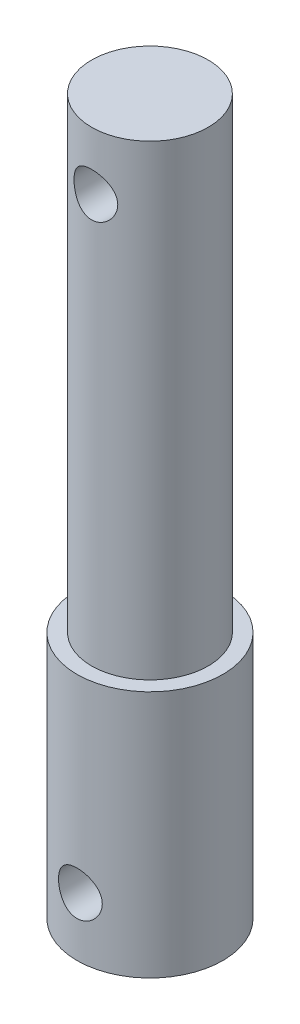
ISO-10303-21;
HEADER;
FILE_DESCRIPTION(('STEP AP214'),'2;1');
FILE_NAME('part.step','',(''),(''),'','','');
FILE_SCHEMA(('AUTOMOTIVE_DESIGN { 1 0 10303 214 1 1 1 1 }'));
ENDSEC;
DATA;
#1=APPLICATION_CONTEXT('core data for automotive mechanical design processes');
#2=APPLICATION_PROTOCOL_DEFINITION('international standard','automotive_design',2000,#1);
#3=PRODUCT_CONTEXT('',#1,'mechanical');
#4=PRODUCT('Part','Part','',(#3));
#5=PRODUCT_RELATED_PRODUCT_CATEGORY('part','',(#4));
#6=PRODUCT_DEFINITION_FORMATION('','',#4);
#7=PRODUCT_DEFINITION_CONTEXT('part definition',#1,'design');
#8=PRODUCT_DEFINITION('design','',#6,#7);
#9=PRODUCT_DEFINITION_SHAPE('','',#8);
#10=(LENGTH_UNIT() NAMED_UNIT(*) SI_UNIT(.MILLI.,.METRE.));
#11=(NAMED_UNIT(*) PLANE_ANGLE_UNIT() SI_UNIT($,.RADIAN.));
#12=(NAMED_UNIT(*) SI_UNIT($,.STERADIAN.) SOLID_ANGLE_UNIT());
#13=UNCERTAINTY_MEASURE_WITH_UNIT(LENGTH_MEASURE(1.E-05),#10,'distance_accuracy_value','');
#14=(GEOMETRIC_REPRESENTATION_CONTEXT(3) GLOBAL_UNCERTAINTY_ASSIGNED_CONTEXT((#13)) GLOBAL_UNIT_ASSIGNED_CONTEXT((#10,
#11,#12)) REPRESENTATION_CONTEXT('',''));
#15=CARTESIAN_POINT('',(0.,0.,0.));
#16=DIRECTION('',(0.,0.,1.));
#17=DIRECTION('',(1.,0.,0.));
#18=AXIS2_PLACEMENT_3D('',#15,#16,#17);
#19=CARTESIAN_POINT('',(0.,17.,0.));
#20=DIRECTION('',(0.,-1.,0.));
#21=DIRECTION('',(0.,0.,-1.));
#22=AXIS2_PLACEMENT_3D('',#19,#20,#21);
#23=CYLINDRICAL_SURFACE('',#22,5.);
#24=CARTESIAN_POINT('',(0.,5.5,-5.));
#25=CARTESIAN_POINT('',(-0.0822886127532999,5.49999900251511,-4.9999992925055));
#26=CARTESIAN_POINT('',(-0.164587318351529,5.49320613637603,-4.99794915693954));
#27=CARTESIAN_POINT('',(-0.326788125304881,5.4662786457779,-4.98997105593691));
#28=CARTESIAN_POINT('',(-0.40668950441142,5.44614004197666,-4.98404193389692));
#29=CARTESIAN_POINT('',(-0.561732707754526,5.39325398308974,-4.96895552501836));
#30=CARTESIAN_POINT('',(-0.636881364395373,5.36052513038106,-4.95980300250425));
#31=CARTESIAN_POINT('',(-0.780624181053131,5.28346390694416,-4.93922109237645));
#32=CARTESIAN_POINT('',(-0.849217467469669,5.23912999260458,-4.92779140192067));
#33=CARTESIAN_POINT('',(-0.979871797183745,5.13877599252733,-4.90350737192774));
#34=CARTESIAN_POINT('',(-1.04171807124434,5.08248337411409,-4.89062383657036));
#35=CARTESIAN_POINT('',(-1.15524920923324,4.96039077008982,-4.86505834210442));
#36=CARTESIAN_POINT('',(-1.20693236327441,4.89458918787504,-4.85237641724501));
#37=CARTESIAN_POINT('',(-1.29980037723708,4.75352924696239,-4.82834113993772));
#38=CARTESIAN_POINT('',(-1.34072309022213,4.67809153900926,-4.81702406663875));
#39=CARTESIAN_POINT('',(-1.4092139477476,4.52101074576971,-4.79743620394031));
#40=CARTESIAN_POINT('',(-1.43678529919973,4.43936915607202,-4.78916468313311));
#41=CARTESIAN_POINT('',(-1.47701633682652,4.27460973386954,-4.77690870838434));
#42=CARTESIAN_POINT('',(-1.49007196234677,4.19159725613606,-4.77281069324533));
#43=CARTESIAN_POINT('',(-1.50213730614672,4.02446684378323,-4.76902789749767));
#44=CARTESIAN_POINT('',(-1.50115042761078,3.94034918194091,-4.76934204760571));
#45=CARTESIAN_POINT('',(-1.48546977199812,3.77661609139152,-4.77424744067778));
#46=CARTESIAN_POINT('',(-1.47127205262685,3.69694774963776,-4.7786838859914));
#47=CARTESIAN_POINT('',(-1.43037420427056,3.54118021372654,-4.79108356228624));
#48=CARTESIAN_POINT('',(-1.40367284141641,3.46508137262567,-4.79904714132351));
#49=CARTESIAN_POINT('',(-1.33816026653682,3.31739965033926,-4.81772733074973));
#50=CARTESIAN_POINT('',(-1.29918816934643,3.24589291604474,-4.82848016115952));
#51=CARTESIAN_POINT('',(-1.21035222588683,3.11026797798981,-4.85150987000065));
#52=CARTESIAN_POINT('',(-1.16048574002588,3.04615157058622,-4.86378711746991));
#53=CARTESIAN_POINT('',(-1.04881290765546,2.92431380923798,-4.88911011297937));
#54=CARTESIAN_POINT('',(-0.986594907466973,2.86697133597033,-4.90216654310498));
#55=CARTESIAN_POINT('',(-0.853263259313967,2.76344601593575,-4.92712244063259));
#56=CARTESIAN_POINT('',(-0.782149051860888,2.71726387158557,-4.9390218351841));
#57=CARTESIAN_POINT('',(-0.632355038342804,2.63714007753527,-4.9604316006947));
#58=CARTESIAN_POINT('',(-0.553627749747951,2.60328248375014,-4.96992543668314));
#59=CARTESIAN_POINT('',(-0.39124541560352,2.54940040990037,-4.98533521832222));
#60=CARTESIAN_POINT('',(-0.307591751589582,2.52937207146751,-4.99125216186999));
#61=CARTESIAN_POINT('',(-0.140952242668332,2.50434782210061,-4.99868364643538));
#62=CARTESIAN_POINT('',(-0.0580500976011873,2.49883841419839,-5.0003485041779));
#63=CARTESIAN_POINT('',(0.107499605823383,2.50156915571208,-4.9995292324176));
#64=CARTESIAN_POINT('',(0.19014719669078,2.50980746965144,-4.99704565677756));
#65=CARTESIAN_POINT('',(0.350903605309697,2.53938461111149,-4.98830696987163));
#66=CARTESIAN_POINT('',(0.429072772614169,2.56042338758087,-4.98213829799417));
#67=CARTESIAN_POINT('',(0.580754638954522,2.6146432327782,-4.96674347841533));
#68=CARTESIAN_POINT('',(0.654266777025584,2.64782576103786,-4.95751696321085));
#69=CARTESIAN_POINT('',(0.796437189461052,2.72625316548113,-4.93669654351325));
#70=CARTESIAN_POINT('',(0.86494382619967,2.77175934094797,-4.92505280829675));
#71=CARTESIAN_POINT('',(0.993523307980147,2.87322475405281,-4.90073468764318));
#72=CARTESIAN_POINT('',(1.05359403235593,2.92918661188767,-4.8880600443108));
#73=CARTESIAN_POINT('',(1.16585744551027,3.05238730836934,-4.86253171869138));
#74=CARTESIAN_POINT('',(1.21768481231503,3.11996187577174,-4.84968825033268));
#75=CARTESIAN_POINT('',(1.30928995072154,3.26312793901353,-4.82576515238464));
#76=CARTESIAN_POINT('',(1.34906803829472,3.33871922455821,-4.81468547654651));
#77=CARTESIAN_POINT('',(1.41517347127168,3.49553249125469,-4.79567189615055));
#78=CARTESIAN_POINT('',(1.4415634693705,3.57672618653659,-4.78772337843827));
#79=CARTESIAN_POINT('',(1.48021730815114,3.74268796893148,-4.77591594362794));
#80=CARTESIAN_POINT('',(1.49248598978779,3.82745482078767,-4.772055625083));
#81=CARTESIAN_POINT('',(1.50221984485059,3.99436151837623,-4.76899972496087));
#82=CARTESIAN_POINT('',(1.5002805530849,4.07646365101759,-4.76961647442754));
#83=CARTESIAN_POINT('',(1.48307505444813,4.2391141033728,-4.77499401288294));
#84=CARTESIAN_POINT('',(1.46780938124716,4.31966248517635,-4.77975463592551));
#85=CARTESIAN_POINT('',(1.42476888804136,4.47594539914285,-4.79275763670386));
#86=CARTESIAN_POINT('',(1.39715175507068,4.55172728736169,-4.80095604545965));
#87=CARTESIAN_POINT('',(1.33031507121129,4.69764243881772,-4.81990278909136));
#88=CARTESIAN_POINT('',(1.29109329962876,4.76777461764076,-4.83065161194312));
#89=CARTESIAN_POINT('',(1.20048763805072,4.90316311652711,-4.85397676425833));
#90=CARTESIAN_POINT('',(1.14871276092994,4.96814876126041,-4.86660540163798));
#91=CARTESIAN_POINT('',(1.03517434629782,5.08870249830786,-4.89201320450026));
#92=CARTESIAN_POINT('',(0.973408217134501,5.14426813946776,-4.90479240823905));
#93=CARTESIAN_POINT('',(0.839465762183248,5.24602341229503,-4.92950936570649));
#94=CARTESIAN_POINT('',(0.767037885790607,5.29189144685549,-4.94141159765674));
#95=CARTESIAN_POINT('',(0.615141373983529,5.37073516990402,-4.96260680455813));
#96=CARTESIAN_POINT('',(0.535676052998955,5.40371688827451,-4.97190099931067));
#97=CARTESIAN_POINT('',(0.380757712655281,5.45289527565275,-4.98602174969301));
#98=CARTESIAN_POINT('',(0.305786961954234,5.47051167288325,-4.99122027381068));
#99=CARTESIAN_POINT('',(0.153880195230779,5.49406352524158,-4.99820944494492));
#100=CARTESIAN_POINT('',(0.0769445098581394,5.50000093270482,-5.0000006615474));
#101=CARTESIAN_POINT('',(0.,5.5,-5.));
#102=B_SPLINE_CURVE_WITH_KNOTS('',3,(#24,#25,#26,#27,#28,#29,#30,#31,#32,#33,#34,#35,#36,#37,
#38,#39,#40,#41,#42,#43,#44,#45,#46,#47,#48,#49,#50,#51,#52,#53,#54,#55,#56,#57,#58,#59,#60,#61,
#62,#63,#64,#65,#66,#67,#68,#69,#70,#71,#72,#73,#74,#75,#76,#77,#78,#79,#80,#81,#82,#83,#84,#85,
#86,#87,#88,#89,#90,#91,#92,#93,#94,#95,#96,#97,#98,#99,#100,#101),.UNSPECIFIED.,.T.,.F.,(4,2,2,
2,2,2,2,2,2,2,2,2,2,2,2,2,2,2,2,2,2,2,2,2,2,2,2,2,2,2,2,2,2,2,2,2,2,2,4),(0.,0.24658320361261,
0.493239964845999,0.739533676300874,0.985860164412702,1.23855602948191,1.49129437288633,
1.74971481004109,2.00807314543224,2.25919689356599,2.51025978319089,2.75226016697676,
2.99428443658001,3.23962426447119,3.48502360158555,3.74067104048167,3.99633456531071,
4.25371046881689,4.51101453528808,4.75908809438545,5.00712853550327,5.24956746682327,
5.49203554593729,5.74011305702908,5.98825282000191,6.24540400322819,6.50254844252681,
6.75847814951252,7.01432009460283,7.25950155466943,7.504673196616,7.74680040402721,
7.98897397553107,8.23996925679931,8.49102974897502,8.74942996156671,9.00770911595235,
9.2383169193046,9.46888616948874),.UNSPECIFIED.);
#103=CARTESIAN_POINT('',(0.,5.5,-5.));
#104=VERTEX_POINT('',#103);
#105=EDGE_CURVE('E10',#104,#104,#102,.T.);
#106=ORIENTED_EDGE('',*,*,#105,.T.);
#107=EDGE_LOOP('',(#106));
#108=FACE_BOUND('',#107,.T.);
#109=CARTESIAN_POINT('',(1.5,4.,4.76969600708473));
#110=CARTESIAN_POINT('',(1.49999897633764,3.9178054520576,4.7696968572698));
#111=CARTESIAN_POINT('',(1.49322108167142,3.83560077585597,4.77184390209069));
#112=CARTESIAN_POINT('',(1.46635844446749,3.67359475040806,4.780165783029));
#113=CARTESIAN_POINT('',(1.44626925573578,3.59379421349853,4.78634196493468));
#114=CARTESIAN_POINT('',(1.39352753269955,3.43896527172827,4.80196102485633));
#115=CARTESIAN_POINT('',(1.36089589394243,3.36392917036691,4.81139846703232));
#116=CARTESIAN_POINT('',(1.28406421917929,3.2203780660047,4.83246932547567));
#117=CARTESIAN_POINT('',(1.23986245137053,3.15186404131556,4.84410307041019));
#118=CARTESIAN_POINT('',(1.13964754141627,3.02113360942262,4.86866862185765));
#119=CARTESIAN_POINT('',(1.08333207175807,2.95915410205371,4.88162808311636));
#120=CARTESIAN_POINT('',(0.961136237579599,2.84536204867749,4.90714861936757));
#121=CARTESIAN_POINT('',(0.895254645461112,2.79355080955012,4.91970964297705));
#122=CARTESIAN_POINT('',(0.75411143779369,2.70053730016669,4.94333214579389));
#123=CARTESIAN_POINT('',(0.678684021335815,2.65957657555719,4.95435724342404));
#124=CARTESIAN_POINT('',(0.521624645369354,2.59101274095724,4.97334435920684));
#125=CARTESIAN_POINT('',(0.439994028387912,2.56340675014255,4.98130703789495));
#126=CARTESIAN_POINT('',(0.275323852630829,2.52311999890949,4.99307646003589));
#127=CARTESIAN_POINT('',(0.192391398953801,2.5100348723473,4.99699557369338));
#128=CARTESIAN_POINT('',(0.0254218237493146,2.49788267535356,5.00063201501348));
#129=CARTESIAN_POINT('',(-0.0586150620503687,2.49881266059804,5.00035022521079));
#130=CARTESIAN_POINT('',(-0.222571156600161,2.51439286854302,4.99569603817659));
#131=CARTESIAN_POINT('',(-0.302536267641342,2.52860519380987,4.9914542020526));
#132=CARTESIAN_POINT('',(-0.458889213442527,2.56963133599429,4.97951522112593));
#133=CARTESIAN_POINT('',(-0.535276821322846,2.59644595094267,4.97181785750586));
#134=CARTESIAN_POINT('',(-0.683347326351281,2.66221202341856,4.95365220986963));
#135=CARTESIAN_POINT('',(-0.754965064694478,2.70130120280727,4.94315269676706));
#136=CARTESIAN_POINT('',(-0.890764673783156,2.79039785242823,4.92049640648069));
#137=CARTESIAN_POINT('',(-0.954944774872131,2.84040791296348,4.90833923637778));
#138=CARTESIAN_POINT('',(-1.0766604815298,2.9521977507516,4.88311550488165));
#139=CARTESIAN_POINT('',(-1.13384458040112,3.01435691902974,4.87003195321461));
#140=CARTESIAN_POINT('',(-1.23707651539824,3.14751001789005,4.84483979887497));
#141=CARTESIAN_POINT('',(-1.28312324482853,3.21850482538923,4.8327312931702));
#142=CARTESIAN_POINT('',(-1.3631399533545,3.36823946924899,4.81077903197678));
#143=CARTESIAN_POINT('',(-1.39698989237679,3.44704704586292,4.80095810695957));
#144=CARTESIAN_POINT('',(-1.45083362878413,3.60960720844554,4.78496392548436));
#145=CARTESIAN_POINT('',(-1.4708319464056,3.69335817153456,4.7787894791583));
#146=CARTESIAN_POINT('',(-1.49574770282165,3.86008236073928,4.77104849541241));
#147=CARTESIAN_POINT('',(-1.50119946380212,3.94296822389398,4.7693187867044));
#148=CARTESIAN_POINT('',(-1.49835947233062,4.10847290000987,4.77021192441924));
#149=CARTESIAN_POINT('',(-1.4900696437133,4.19109174873085,4.77283416156589));
#150=CARTESIAN_POINT('',(-1.4604576357419,4.35148837797087,4.78197558554912));
#151=CARTESIAN_POINT('',(-1.4394796143128,4.42933616426352,4.78839176507489));
#152=CARTESIAN_POINT('',(-1.3854857774794,4.58040169081492,4.80429141231227));
#153=CARTESIAN_POINT('',(-1.35246810342759,4.65361871414057,4.81377535359073));
#154=CARTESIAN_POINT('',(-1.274318711965,4.79551746407213,4.83505835023047));
#155=CARTESIAN_POINT('',(-1.22888564172729,4.86402472098579,4.84691271069799));
#156=CARTESIAN_POINT('',(-1.12755301600385,4.9926381061808,4.87148205646987));
#157=CARTESIAN_POINT('',(-1.07165095534897,5.05274221761279,4.88419724730003));
#158=CARTESIAN_POINT('',(-0.948455132493598,5.16518040581474,4.90963633548158));
#159=CARTESIAN_POINT('',(-0.880811065857434,5.21713562898698,4.92234245063004));
#160=CARTESIAN_POINT('',(-0.737461784590249,5.30896670102775,4.94584851748651));
#161=CARTESIAN_POINT('',(-0.661756970543943,5.34884314978146,4.95664856384717));
#162=CARTESIAN_POINT('',(-0.504935504705221,5.41500003056829,4.97505970474957));
#163=CARTESIAN_POINT('',(-0.423864622037839,5.44138201615898,4.98269453424966));
#164=CARTESIAN_POINT('',(-0.258169966504588,5.48006091889042,4.99401979596827));
#165=CARTESIAN_POINT('',(-0.173547217354762,5.49236186594842,4.9977113567088));
#166=CARTESIAN_POINT('',(-0.00665215388274264,5.5022230440545,5.00066544081399));
#167=CARTESIAN_POINT('',(0.0755851790862068,5.50033269540783,5.00009305111322));
#168=CARTESIAN_POINT('',(0.238519481164404,5.48317836750088,4.99497264465037));
#169=CARTESIAN_POINT('',(0.319216537346529,5.46791514651956,4.99042485330463));
#170=CARTESIAN_POINT('',(0.475935813041358,5.42478833860037,4.97791168358327));
#171=CARTESIAN_POINT('',(0.551998927351392,5.39706181935099,4.96998352900866));
#172=CARTESIAN_POINT('',(0.698433237752053,5.32991808549281,4.9515294303945));
#173=CARTESIAN_POINT('',(0.76880349605058,5.29049894971381,4.94100305949946));
#174=CARTESIAN_POINT('',(0.904301892420563,5.19962654256996,4.91803965828228));
#175=CARTESIAN_POINT('',(0.969190250076766,5.14782856999923,4.90555226923559));
#176=CARTESIAN_POINT('',(1.08953757134594,5.0342896116672,4.88023537212334));
#177=CARTESIAN_POINT('',(1.14499380960193,4.97254576210185,4.86740576641079));
#178=CARTESIAN_POINT('',(1.24656269394549,4.83865922168949,4.84240680631319));
#179=CARTESIAN_POINT('',(1.29234759757956,4.76626144660956,4.83026852693485));
#180=CARTESIAN_POINT('',(1.37104313528776,4.61444482583898,4.80852547508793));
#181=CARTESIAN_POINT('',(1.40395995557289,4.5350293763988,4.79891948596955));
#182=CARTESIAN_POINT('',(1.4530194253295,4.38025956839372,4.78427816717595));
#183=CARTESIAN_POINT('',(1.47058859011232,4.30539135306901,4.7788615484052));
#184=CARTESIAN_POINT('',(1.49407818835144,4.15368477750423,4.77157042597167));
#185=CARTESIAN_POINT('',(1.50000095706095,4.07684681535475,4.7696952122143));
#186=CARTESIAN_POINT('',(1.5,4.,4.76969600708473));
#187=B_SPLINE_CURVE_WITH_KNOTS('',3,(#109,#110,#111,#112,#113,#114,#115,#116,#117,#118,#119,
#120,#121,#122,#123,#124,#125,#126,#127,#128,#129,#130,#131,#132,#133,#134,#135,#136,#137,#138,
#139,#140,#141,#142,#143,#144,#145,#146,#147,#148,#149,#150,#151,#152,#153,#154,#155,#156,#157,
#158,#159,#160,#161,#162,#163,#164,#165,#166,#167,#168,#169,#170,#171,#172,#173,#174,#175,#176,
#177,#178,#179,#180,#181,#182,#183,#184,#185,#186),.UNSPECIFIED.,.T.,.F.,(4,2,2,2,2,2,2,2,2,2,2,
2,2,2,2,2,2,2,2,2,2,2,2,2,2,2,2,2,2,2,2,2,2,2,2,2,2,2,4),(0.,0.246300165915542,0.492682641689,
0.738656414466194,0.984667025370101,1.23773150007984,1.49082847871273,1.74915939273645,
2.00743455587877,2.25832140149558,2.5091555410144,2.7520012599088,2.99486235890376,
3.24055209335676,3.4863001659083,3.74152147023278,3.99676812491863,4.25446238246266,
4.51207250628411,4.76008080790309,5.00805439107388,5.24958594938817,5.49115481045787,
5.73920731809388,5.98731925928923,6.24479506100602,6.50225807324202,6.75775391814325,
7.01317662321682,7.2587630391122,7.50433553047755,7.74727096872219,7.99024634491378,
8.24099627054488,8.4918185262989,8.75011639669147,9.00828993963944,9.23861153857448,
9.4688869503356),.UNSPECIFIED.);
#188=CARTESIAN_POINT('',(1.5,4.,4.76969600708473));
#189=VERTEX_POINT('',#188);
#190=EDGE_CURVE('E53',#189,#189,#187,.T.);
#191=ORIENTED_EDGE('',*,*,#190,.T.);
#192=EDGE_LOOP('',(#191));
#193=FACE_BOUND('',#192,.T.);
#194=CARTESIAN_POINT('',(0.,17.,0.));
#195=DIRECTION('',(0.,1.,0.));
#196=DIRECTION('',(0.,0.,1.));
#197=AXIS2_PLACEMENT_3D('',#194,#195,#196);
#198=CIRCLE('',#197,5.);
#199=CARTESIAN_POINT('',(0.,17.,5.));
#200=VERTEX_POINT('',#199);
#201=EDGE_CURVE('E58',#200,#200,#198,.T.);
#202=ORIENTED_EDGE('',*,*,#201,.F.);
#203=EDGE_LOOP('',(#202));
#204=FACE_BOUND('',#203,.T.);
#205=CARTESIAN_POINT('',(0.,0.,0.));
#206=DIRECTION('',(0.,1.,0.));
#207=DIRECTION('',(0.,0.,1.));
#208=AXIS2_PLACEMENT_3D('',#205,#206,#207);
#209=CIRCLE('',#208,5.);
#210=CARTESIAN_POINT('',(0.,0.,5.));
#211=VERTEX_POINT('',#210);
#212=EDGE_CURVE('E63',#211,#211,#209,.T.);
#213=ORIENTED_EDGE('',*,*,#212,.T.);
#214=EDGE_LOOP('',(#213));
#215=FACE_BOUND('',#214,.T.);
#216=ADVANCED_FACE('F41',(#108,#193,#204,#215),#23,.T.);
#217=CARTESIAN_POINT('',(0.,17.,0.));
#218=DIRECTION('',(0.,1.,0.));
#219=DIRECTION('',(0.,0.,1.));
#220=AXIS2_PLACEMENT_3D('',#217,#218,#219);
#221=PLANE('',#220);
#222=CARTESIAN_POINT('',(0.,17.,0.));
#223=DIRECTION('',(0.,1.,0.));
#224=DIRECTION('',(0.,0.,1.));
#225=AXIS2_PLACEMENT_3D('',#222,#223,#224);
#226=CIRCLE('',#225,4.);
#227=CARTESIAN_POINT('',(0.,17.,4.));
#228=VERTEX_POINT('',#227);
#229=EDGE_CURVE('E104',#228,#228,#226,.F.);
#230=ORIENTED_EDGE('',*,*,#229,.T.);
#231=EDGE_LOOP('',(#230));
#232=FACE_BOUND('',#231,.T.);
#233=ORIENTED_EDGE('',*,*,#201,.T.);
#234=EDGE_LOOP('',(#233));
#235=FACE_BOUND('',#234,.T.);
#236=ADVANCED_FACE('F93',(#232,#235),#221,.T.);
#237=CARTESIAN_POINT('',(0.,0.,0.));
#238=DIRECTION('',(0.,1.,0.));
#239=DIRECTION('',(0.,0.,1.));
#240=AXIS2_PLACEMENT_3D('',#237,#238,#239);
#241=PLANE('',#240);
#242=ORIENTED_EDGE('',*,*,#212,.F.);
#243=EDGE_LOOP('',(#242));
#244=FACE_BOUND('',#243,.T.);
#245=ADVANCED_FACE('F91',(#244),#241,.F.);
#246=CARTESIAN_POINT('',(0.,49.,0.));
#247=DIRECTION('',(0.,-1.,0.));
#248=DIRECTION('',(0.,0.,-1.));
#249=AXIS2_PLACEMENT_3D('',#246,#247,#248);
#250=CYLINDRICAL_SURFACE('',#249,4.);
#251=CARTESIAN_POINT('',(0.,46.5,-4.));
#252=CARTESIAN_POINT('',(-0.0812350589378531,46.5000029023031,-4.00000217456151));
#253=CARTESIAN_POINT('',(-0.162450241781793,46.4933802397516,-3.99750379283184));
#254=CARTESIAN_POINT('',(-0.322453452352362,46.4671718047301,-3.98778696006928));
#255=CARTESIAN_POINT('',(-0.401241827987617,46.4475878995294,-3.98056918893993));
#256=CARTESIAN_POINT('',(-0.554060784990879,46.3962469982282,-3.96218832391545));
#257=CARTESIAN_POINT('',(-0.628100224162276,46.3645134831782,-3.9510328434944));
#258=CARTESIAN_POINT('',(-0.769799310160253,46.2898935869842,-3.92588767765353));
#259=CARTESIAN_POINT('',(-0.837457239177881,46.2470042144558,-3.91189723227548));
#260=CARTESIAN_POINT('',(-0.967346417045828,46.1493874689291,-3.88186246971217));
#261=CARTESIAN_POINT('',(-1.02927073015119,46.0942697377406,-3.86576002583566));
#262=CARTESIAN_POINT('',(-1.14324421474363,45.9745895653412,-3.83360220871327));
#263=CARTESIAN_POINT('',(-1.19529036359203,45.9100242439121,-3.81754685135033));
#264=CARTESIAN_POINT('',(-1.28998202215985,45.7702825324768,-3.78662470617731));
#265=CARTESIAN_POINT('',(-1.3321939319576,45.6947956334542,-3.77182648820818));
#266=CARTESIAN_POINT('',(-1.40318646334085,45.5371516458315,-3.74599860237433));
#267=CARTESIAN_POINT('',(-1.43197244961239,45.4549972368449,-3.73496742975881));
#268=CARTESIAN_POINT('',(-1.47408431017549,45.2898832597418,-3.71854412824136));
#269=CARTESIAN_POINT('',(-1.48799593218558,45.2070949615646,-3.71293924350838));
#270=CARTESIAN_POINT('',(-1.50179556531648,45.0401838420062,-3.70738061461215));
#271=CARTESIAN_POINT('',(-1.50168936802631,44.9560615861255,-3.70742453659305));
#272=CARTESIAN_POINT('',(-1.48790429610018,44.794230474787,-3.71297511632055));
#273=CARTESIAN_POINT('',(-1.47503808509003,44.7164390939558,-3.71815468871122));
#274=CARTESIAN_POINT('',(-1.4374416786833,44.5642128495947,-3.73284938059529));
#275=CARTESIAN_POINT('',(-1.41270969663258,44.4897784933861,-3.74236515298863));
#276=CARTESIAN_POINT('',(-1.35163748571904,44.3447229322718,-3.76485702190253));
#277=CARTESIAN_POINT('',(-1.31508648737101,44.2742005138787,-3.77789517988166));
#278=CARTESIAN_POINT('',(-1.23156073762698,44.140054262409,-3.80594210139319));
#279=CARTESIAN_POINT('',(-1.18458238728897,44.0764328224803,-3.82095154457158));
#280=CARTESIAN_POINT('',(-1.07781780766549,43.9533963363491,-3.85248038859113));
#281=CARTESIAN_POINT('',(-1.01738298716956,43.8945513592519,-3.86903347455671));
#282=CARTESIAN_POINT('',(-0.887312590819019,43.7876620337942,-3.90091728164086));
#283=CARTESIAN_POINT('',(-0.81767560349736,43.7396193453943,-3.91624781465952));
#284=CARTESIAN_POINT('',(-0.669723436992414,43.6550696029375,-3.9442639480908));
#285=CARTESIAN_POINT('',(-0.591290713844714,43.6187524187789,-3.95690498259616));
#286=CARTESIAN_POINT('',(-0.428836850524579,43.56001739573,-3.97778718326962));
#287=CARTESIAN_POINT('',(-0.344818210845764,43.5375933834389,-3.98603030341493));
#288=CARTESIAN_POINT('',(-0.178375243148663,43.5083772124581,-3.99684443228065));
#289=CARTESIAN_POINT('',(-0.0961036195622077,43.5008173936175,-3.99969369025686));
#290=CARTESIAN_POINT('',(0.0685724752550255,43.4993089361001,-4.00025893700126));
#291=CARTESIAN_POINT('',(0.150976912983374,43.5053572796832,-3.99797606386863));
#292=CARTESIAN_POINT('',(0.310262048561861,43.5303100423087,-3.98871709772643));
#293=CARTESIAN_POINT('',(0.387233328007338,43.5487115437371,-3.98192470962305));
#294=CARTESIAN_POINT('',(0.536941754957223,43.5971860725473,-3.96451477091717));
#295=CARTESIAN_POINT('',(0.609678350347535,43.627260617948,-3.9538967228203));
#296=CARTESIAN_POINT('',(0.751247765110156,43.6991864124395,-3.92949624407681));
#297=CARTESIAN_POINT('',(0.819903083557796,43.7413577292234,-3.91563000209348));
#298=CARTESIAN_POINT('',(0.949392711726627,43.8359181031716,-3.88626671564664));
#299=CARTESIAN_POINT('',(1.01022412027045,43.8883109325452,-3.87076907009516));
#300=CARTESIAN_POINT('',(1.12603079874454,44.0054041221243,-3.8387332949099));
#301=CARTESIAN_POINT('',(1.18046154123569,44.0706421827727,-3.82218696503729));
#302=CARTESIAN_POINT('',(1.27771050031903,44.2096513847076,-3.79078815746854));
#303=CARTESIAN_POINT('',(1.32052767414518,44.2834232913885,-3.77593583194399));
#304=CARTESIAN_POINT('',(1.39337773518998,44.4380159867723,-3.74966829822463));
#305=CARTESIAN_POINT('',(1.42335685446918,44.5188647459104,-3.73826760328493));
#306=CARTESIAN_POINT('',(1.46907883466889,44.6850097636878,-3.72054032891005));
#307=CARTESIAN_POINT('',(1.48483050305535,44.7703032361981,-3.71421061057491));
#308=CARTESIAN_POINT('',(1.50086347097839,44.9370161595411,-3.70775894792573));
#309=CARTESIAN_POINT('',(1.50207331495837,45.0183326317169,-3.70726444523341));
#310=CARTESIAN_POINT('',(1.49136715641593,45.1799453162762,-3.71158412745292));
#311=CARTESIAN_POINT('',(1.47945239850123,45.2602416246716,-3.71639780898899));
#312=CARTESIAN_POINT('',(1.44355815630241,45.4150472267165,-3.73048141585432));
#313=CARTESIAN_POINT('',(1.41995798316524,45.4896583462453,-3.73961085376663));
#314=CARTESIAN_POINT('',(1.36169696779919,45.6339055084944,-3.76121548297845));
#315=CARTESIAN_POINT('',(1.32703332944944,45.7035402880701,-3.77369151995215));
#316=CARTESIAN_POINT('',(1.24552075938153,45.8398267896976,-3.80139723903965));
#317=CARTESIAN_POINT('',(1.1981283280301,45.9061307967999,-3.81673698440964));
#318=CARTESIAN_POINT('',(1.09334485729906,46.0301415609712,-3.84806246757177));
#319=CARTESIAN_POINT('',(1.03595064012808,46.0878455747868,-3.86404840943145));
#320=CARTESIAN_POINT('',(0.909080396784618,46.1962019558218,-3.89590424609881));
#321=CARTESIAN_POINT('',(0.839118644212987,46.2463037534347,-3.91172104900645));
#322=CARTESIAN_POINT('',(0.691213223200817,46.3340226552766,-3.94054514457031));
#323=CARTESIAN_POINT('',(0.613268934090617,46.3716387877364,-3.95355221851559));
#324=CARTESIAN_POINT('',(0.447999082002309,46.4343768290483,-3.9757429260668));
#325=CARTESIAN_POINT('',(0.360413422234205,46.4588870646019,-3.98473657158356));
#326=CARTESIAN_POINT('',(0.18187573360638,46.4916929599207,-3.99686242179587));
#327=CARTESIAN_POINT('',(0.090925416364858,46.4999967514873,-3.99999756603967));
#328=CARTESIAN_POINT('',(0.,46.5,-4.));
#329=B_SPLINE_CURVE_WITH_KNOTS('',3,(#251,#252,#253,#254,#255,#256,#257,#258,#259,#260,#261,
#262,#263,#264,#265,#266,#267,#268,#269,#270,#271,#272,#273,#274,#275,#276,#277,#278,#279,#280,
#281,#282,#283,#284,#285,#286,#287,#288,#289,#290,#291,#292,#293,#294,#295,#296,#297,#298,#299,
#300,#301,#302,#303,#304,#305,#306,#307,#308,#309,#310,#311,#312,#313,#314,#315,#316,#317,#318,
#319,#320,#321,#322,#323,#324,#325,#326,#327,#328),.UNSPECIFIED.,.T.,.F.,(4,2,2,2,2,2,2,2,2,2,2,
2,2,2,2,2,2,2,2,2,2,2,2,2,2,2,2,2,2,2,2,2,2,2,2,2,2,2,4),(0.,0.243369801560561,
0.486704549530461,0.729571369213572,0.972503379609492,1.22473618582716,1.47704604925622,
1.73896674501659,2.00078269352134,2.25185874416902,2.50283106079707,2.73878345119971,
2.97477138060588,3.21522408387018,3.45575990744258,3.71246153335813,3.96920257905066,
4.22991375286076,4.49050899698846,4.73725019635926,4.98393668390521,5.2211443792384,
5.45838293254454,5.702592218596,5.94689180019868,6.20536519455658,6.46386178920141,
6.72343066727204,6.98283874956507,7.22558763480252,7.46831350211259,7.70363142426534,
7.93900886656507,8.18672471884272,8.43451941997062,8.69572329654039,8.95694749805102,
9.22948515032042,9.50188601796127),.UNSPECIFIED.);
#330=CARTESIAN_POINT('',(0.,46.5,-4.));
#331=VERTEX_POINT('',#330);
#332=EDGE_CURVE('E69',#331,#331,#329,.T.);
#333=ORIENTED_EDGE('',*,*,#332,.T.);
#334=EDGE_LOOP('',(#333));
#335=FACE_BOUND('',#334,.T.);
#336=CARTESIAN_POINT('',(1.5,45.,3.70809924354783));
#337=CARTESIAN_POINT('',(1.50000304106109,44.9189925162792,3.70809640633806));
#338=CARTESIAN_POINT('',(1.49341597549487,44.8380050774964,3.71078260240986));
#339=CARTESIAN_POINT('',(1.46736187895468,44.6784719170868,3.72116159304967));
#340=CARTESIAN_POINT('',(1.44789523373263,44.599926122405,3.72885423767112));
#341=CARTESIAN_POINT('',(1.39689657610574,44.4476246283865,3.748254802809));
#342=CARTESIAN_POINT('',(1.36539347266348,44.3738579433489,3.7599530956926));
#343=CARTESIAN_POINT('',(1.29131856742697,44.2326281031812,3.78603134206598));
#344=CARTESIAN_POINT('',(1.24874344095039,44.1651668497175,3.80041210067323));
#345=CARTESIAN_POINT('',(1.15146661374162,44.0351096883772,3.83103574665713));
#346=CARTESIAN_POINT('',(1.09630381213306,43.9728714703706,3.84733341923603));
#347=CARTESIAN_POINT('',(0.976395839778926,43.8582771853285,3.87949750628547));
#348=CARTESIAN_POINT('',(0.911648630256681,43.8059232262581,3.89536382814785));
#349=CARTESIAN_POINT('',(0.771694655177603,43.7108604877044,3.92552873936553));
#350=CARTESIAN_POINT('',(0.696206947538031,43.6685405252841,3.93975561223505));
#351=CARTESIAN_POINT('',(0.53855577196525,43.5973488274751,3.96438007973847));
#352=CARTESIAN_POINT('',(0.456394630933539,43.568472428008,3.97477900217006));
#353=CARTESIAN_POINT('',(0.291489341676834,43.5262421042254,3.9901869710344));
#354=CARTESIAN_POINT('',(0.208923197281599,43.5122723725595,3.99540915214774));
#355=CARTESIAN_POINT('',(0.0424643637947883,43.498278799055,4.0006401410794));
#356=CARTESIAN_POINT('',(-0.0414278850628308,43.4982504223813,4.00065064414902));
#357=CARTESIAN_POINT('',(-0.203743543064474,43.5117817614652,3.99559265903894));
#358=CARTESIAN_POINT('',(-0.282232178266898,43.5246692979488,3.99077541996683));
#359=CARTESIAN_POINT('',(-0.43583921798439,43.5625359152256,3.97693274932263));
#360=CARTESIAN_POINT('',(-0.510957383430298,43.587515852262,3.96790701975578));
#361=CARTESIAN_POINT('',(-0.656989017303103,43.6491704516758,3.94637769167531));
#362=CARTESIAN_POINT('',(-0.727825392287308,43.6860100052684,3.93382539470077));
#363=CARTESIAN_POINT('',(-0.862486607957558,43.7701920969294,3.90651310225279));
#364=CARTESIAN_POINT('',(-0.926309176932322,43.8175380230176,3.8917523951284));
#365=CARTESIAN_POINT('',(-1.04909048680094,43.9246272862832,3.86052529655816));
#366=CARTESIAN_POINT('',(-1.10754614526348,43.9849339156504,3.84400963763883));
#367=CARTESIAN_POINT('',(-1.21370395569342,44.1145929933216,3.81182460645722));
#368=CARTESIAN_POINT('',(-1.261403406929,44.1839477065866,3.79615544748847));
#369=CARTESIAN_POINT('',(-1.34565611808151,44.3317194674628,3.76712703500335));
#370=CARTESIAN_POINT('',(-1.38193847851831,44.4103034936861,3.75382677150277));
#371=CARTESIAN_POINT('',(-1.44056464441501,44.5730962251676,3.73172438629003));
#372=CARTESIAN_POINT('',(-1.46291620605595,44.6573017715937,3.72291976205783));
#373=CARTESIAN_POINT('',(-1.49190191709668,44.8239759623159,3.71139597222848));
#374=CARTESIAN_POINT('',(-1.49933521158966,44.9062841055361,3.70836785241537));
#375=CARTESIAN_POINT('',(-1.50057885636272,45.0710093567417,3.70786539525016));
#376=CARTESIAN_POINT('',(-1.49439261093762,45.1534264323525,3.71038967003987));
#377=CARTESIAN_POINT('',(-1.46929733520157,45.3119299222877,3.72039381629735));
#378=CARTESIAN_POINT('',(-1.45100618334224,45.3881311357647,3.72763276216449));
#379=CARTESIAN_POINT('',(-1.40299774640637,45.5363479447202,3.74596487046362));
#380=CARTESIAN_POINT('',(-1.37327812034623,45.6083626791681,3.75705882250173));
#381=CARTESIAN_POINT('',(-1.30200292275278,45.7491644380762,3.7823624311608));
#382=CARTESIAN_POINT('',(-1.26004545177047,45.8177292921373,3.79667328892065));
#383=CARTESIAN_POINT('',(-1.16591317862479,45.947128981726,3.82662814294291));
#384=CARTESIAN_POINT('',(-1.11373463696435,46.0079609746246,3.84227262594077));
#385=CARTESIAN_POINT('',(-0.996727340900938,46.1241683731951,3.87433046553184));
#386=CARTESIAN_POINT('',(-0.931306341491062,46.1789534087687,3.89072969357027));
#387=CARTESIAN_POINT('',(-0.791797471753153,46.2768383675894,3.92149874963302));
#388=CARTESIAN_POINT('',(-0.717709573322675,46.3199382529458,3.93586857107664));
#389=CARTESIAN_POINT('',(-0.563016329468478,46.3929460561996,3.96094985704552));
#390=CARTESIAN_POINT('',(-0.482434433064628,46.4228991237926,3.9716738133801));
#391=CARTESIAN_POINT('',(-0.316881887523257,46.4686564138499,3.98829436712571));
#392=CARTESIAN_POINT('',(-0.231913320723594,46.4844672854224,3.99419323299412));
#393=CARTESIAN_POINT('',(-0.0653355852738165,46.5007744027548,4.00028407317073));
#394=CARTESIAN_POINT('',(0.0161807680608446,46.502109483059,4.00078860953764));
#395=CARTESIAN_POINT('',(0.178226786412423,46.4915848405546,3.99684889809224));
#396=CARTESIAN_POINT('',(0.258756569245256,46.4797267091141,3.9924052471313));
#397=CARTESIAN_POINT('',(0.414548248377128,46.4437411485064,3.97921089603771));
#398=CARTESIAN_POINT('',(0.489890731068839,46.4199200941216,3.97056791378017));
#399=CARTESIAN_POINT('',(0.635515473006394,46.3609899866156,3.9498778362099));
#400=CARTESIAN_POINT('',(0.705796771275544,46.3258787966952,3.93783009655664));
#401=CARTESIAN_POINT('',(0.842540176994412,46.2436860564952,3.91090618300074));
#402=CARTESIAN_POINT('',(0.90871754884685,46.1961633594859,3.89593240108828));
#403=CARTESIAN_POINT('',(1.03241734752336,46.0911921698124,3.86499507694844));
#404=CARTESIAN_POINT('',(1.0899366712559,46.0337401341921,3.84903118274027));
#405=CARTESIAN_POINT('',(1.19781214236195,45.9069358683549,3.81688129739175));
#406=CARTESIAN_POINT('',(1.24762999816025,45.8371155978457,3.8007280534916));
#407=CARTESIAN_POINT('',(1.33484709556843,45.6895841304267,3.77098325003638));
#408=CARTESIAN_POINT('',(1.37224504878157,45.6118721159465,3.75739195631217));
#409=CARTESIAN_POINT('',(1.4346588697426,45.4470443190246,3.73402269853266));
#410=CARTESIAN_POINT('',(1.45906002899523,45.3596656334882,3.7244380329086));
#411=CARTESIAN_POINT('',(1.49172356722079,45.1815147280442,3.71147994336315));
#412=CARTESIAN_POINT('',(1.49999659339571,45.09074478729,3.70810242179736));
#413=CARTESIAN_POINT('',(1.5,45.,3.70809924354783));
#414=B_SPLINE_CURVE_WITH_KNOTS('',3,(#336,#337,#338,#339,#340,#341,#342,#343,#344,#345,#346,
#347,#348,#349,#350,#351,#352,#353,#354,#355,#356,#357,#358,#359,#360,#361,#362,#363,#364,#365,
#366,#367,#368,#369,#370,#371,#372,#373,#374,#375,#376,#377,#378,#379,#380,#381,#382,#383,#384,
#385,#386,#387,#388,#389,#390,#391,#392,#393,#394,#395,#396,#397,#398,#399,#400,#401,#402,#403,
#404,#405,#406,#407,#408,#409,#410,#411,#412,#413),.UNSPECIFIED.,.T.,.F.,(4,2,2,2,2,2,2,2,2,2,2,
2,2,2,2,2,2,2,2,2,2,2,2,2,2,2,2,2,2,2,2,2,2,2,2,2,2,2,4),(0.,0.242684541416171,
0.485361814598854,0.727459856757033,0.969630679682934,1.22274652401128,1.47591628822983,
1.73770072136421,1.9993942638133,2.24980018489679,2.50012465404857,2.73806472803194,
2.97602165263335,3.21744131210668,3.45893893628976,3.71456675065875,3.97025867827335,
4.23162592252966,4.49284751635474,4.73965657740486,4.98640395388885,5.22143845928199,
5.45652113429527,5.70041561005822,5.94439948466355,6.20385016993624,6.46330169650178,
6.72185508890168,6.98028685560127,7.22365720549936,7.4669982031948,7.70440274003891,
7.94185223512831,8.18928323676987,8.43680270894964,8.69738599542078,8.95799630544242,
9.23003178870927,9.50188762323053),.UNSPECIFIED.);
#415=CARTESIAN_POINT('',(1.5,45.,3.70809924354783));
#416=VERTEX_POINT('',#415);
#417=EDGE_CURVE('E95',#416,#416,#414,.T.);
#418=ORIENTED_EDGE('',*,*,#417,.T.);
#419=EDGE_LOOP('',(#418));
#420=FACE_BOUND('',#419,.T.);
#421=ORIENTED_EDGE('',*,*,#229,.F.);
#422=EDGE_LOOP('',(#421));
#423=FACE_BOUND('',#422,.T.);
#424=CARTESIAN_POINT('',(0.,49.,0.));
#425=DIRECTION('',(0.,1.,0.));
#426=DIRECTION('',(0.,0.,1.));
#427=AXIS2_PLACEMENT_3D('',#424,#425,#426);
#428=CIRCLE('',#427,4.);
#429=CARTESIAN_POINT('',(0.,49.,4.));
#430=VERTEX_POINT('',#429);
#431=EDGE_CURVE('E109',#430,#430,#428,.T.);
#432=ORIENTED_EDGE('',*,*,#431,.F.);
#433=EDGE_LOOP('',(#432));
#434=FACE_BOUND('',#433,.T.);
#435=ADVANCED_FACE('F86',(#335,#420,#423,#434),#250,.T.);
#436=CARTESIAN_POINT('',(0.,49.,0.));
#437=DIRECTION('',(0.,1.,0.));
#438=DIRECTION('',(0.,0.,1.));
#439=AXIS2_PLACEMENT_3D('',#436,#437,#438);
#440=PLANE('',#439);
#441=ORIENTED_EDGE('',*,*,#431,.T.);
#442=EDGE_LOOP('',(#441));
#443=FACE_BOUND('',#442,.T.);
#444=ADVANCED_FACE('F83',(#443),#440,.T.);
#445=CARTESIAN_POINT('',(0.,45.,-5.));
#446=DIRECTION('',(0.,0.,1.));
#447=DIRECTION('',(1.,0.,0.));
#448=AXIS2_PLACEMENT_3D('',#445,#446,#447);
#449=CYLINDRICAL_SURFACE('',#448,1.5);
#450=ORIENTED_EDGE('',*,*,#417,.F.);
#451=EDGE_LOOP('',(#450));
#452=FACE_BOUND('',#451,.T.);
#453=ORIENTED_EDGE('',*,*,#332,.F.);
#454=EDGE_LOOP('',(#453));
#455=FACE_BOUND('',#454,.T.);
#456=ADVANCED_FACE('F80',(#452,#455),#449,.F.);
#457=CARTESIAN_POINT('',(0.,4.,-5.));
#458=DIRECTION('',(0.,0.,1.));
#459=DIRECTION('',(1.,0.,0.));
#460=AXIS2_PLACEMENT_3D('',#457,#458,#459);
#461=CYLINDRICAL_SURFACE('',#460,1.5);
#462=ORIENTED_EDGE('',*,*,#190,.F.);
#463=EDGE_LOOP('',(#462));
#464=FACE_BOUND('',#463,.T.);
#465=ORIENTED_EDGE('',*,*,#105,.F.);
#466=EDGE_LOOP('',(#465));
#467=FACE_BOUND('',#466,.T.);
#468=ADVANCED_FACE('F76',(#464,#467),#461,.F.);
#469=CLOSED_SHELL('',(#216,#236,#245,#435,#444,#456,#468));
#470=MANIFOLD_SOLID_BREP('B2',#469);
#471=ADVANCED_BREP_SHAPE_REPRESENTATION('',(#18,#470),#14);
#472=SHAPE_DEFINITION_REPRESENTATION(#9,#471);
ENDSEC;
END-ISO-10303-21;
